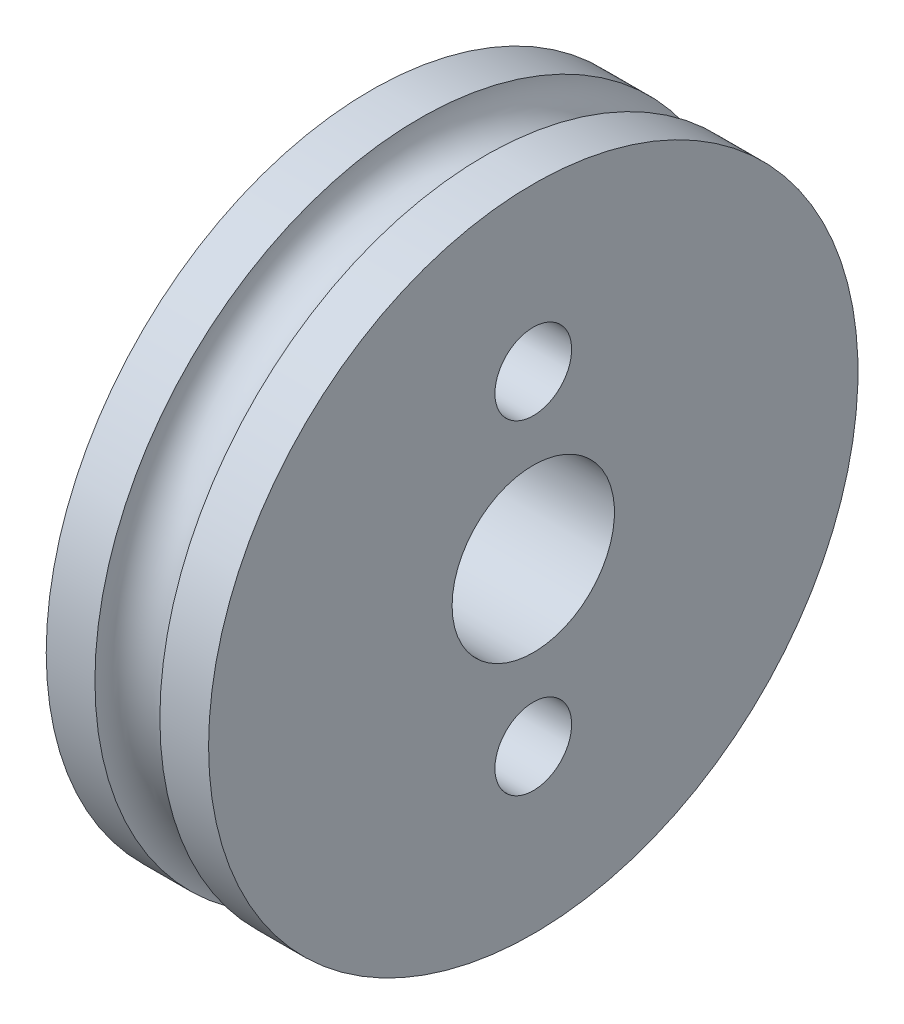
ISO-10303-21;
HEADER;
FILE_DESCRIPTION(('STEP AP214'),'2;1');
FILE_NAME('part.step','',(''),(''),'','','');
FILE_SCHEMA(('AUTOMOTIVE_DESIGN { 1 0 10303 214 1 1 1 1 }'));
ENDSEC;
DATA;
#1=APPLICATION_CONTEXT('core data for automotive mechanical design processes');
#2=APPLICATION_PROTOCOL_DEFINITION('international standard','automotive_design',2000,#1);
#3=PRODUCT_CONTEXT('',#1,'mechanical');
#4=PRODUCT('Part','Part','',(#3));
#5=PRODUCT_RELATED_PRODUCT_CATEGORY('part','',(#4));
#6=PRODUCT_DEFINITION_FORMATION('','',#4);
#7=PRODUCT_DEFINITION_CONTEXT('part definition',#1,'design');
#8=PRODUCT_DEFINITION('design','',#6,#7);
#9=PRODUCT_DEFINITION_SHAPE('','',#8);
#10=(LENGTH_UNIT() NAMED_UNIT(*) SI_UNIT(.MILLI.,.METRE.));
#11=(NAMED_UNIT(*) PLANE_ANGLE_UNIT() SI_UNIT($,.RADIAN.));
#12=(NAMED_UNIT(*) SI_UNIT($,.STERADIAN.) SOLID_ANGLE_UNIT());
#13=UNCERTAINTY_MEASURE_WITH_UNIT(LENGTH_MEASURE(1.E-05),#10,'distance_accuracy_value','');
#14=(GEOMETRIC_REPRESENTATION_CONTEXT(3) GLOBAL_UNCERTAINTY_ASSIGNED_CONTEXT((#13)) GLOBAL_UNIT_ASSIGNED_CONTEXT((#10,
#11,#12)) REPRESENTATION_CONTEXT('',''));
#15=CARTESIAN_POINT('',(0.,0.,0.));
#16=DIRECTION('',(0.,0.,1.));
#17=DIRECTION('',(1.,0.,0.));
#18=AXIS2_PLACEMENT_3D('',#15,#16,#17);
#19=CARTESIAN_POINT('',(0.,3.175,0.));
#20=DIRECTION('',(1.,0.,0.));
#21=DIRECTION('',(0.,0.,-1.));
#22=AXIS2_PLACEMENT_3D('',#19,#20,#21);
#23=PLANE('',#22);
#24=CARTESIAN_POINT('',(0.,6.35,0.));
#25=DIRECTION('',(-1.,0.,0.));
#26=DIRECTION('',(0.,0.,1.));
#27=AXIS2_PLACEMENT_3D('',#24,#25,#26);
#28=CIRCLE('',#27,1.525);
#29=CARTESIAN_POINT('',(0.,6.35,1.525));
#30=VERTEX_POINT('',#29);
#31=EDGE_CURVE('E76',#30,#30,#28,.T.);
#32=ORIENTED_EDGE('',*,*,#31,.F.);
#33=EDGE_LOOP('',(#32));
#34=FACE_BOUND('',#33,.T.);
#35=CARTESIAN_POINT('',(0.,-6.35,0.));
#36=DIRECTION('',(-1.,0.,0.));
#37=DIRECTION('',(0.,0.,1.));
#38=AXIS2_PLACEMENT_3D('',#35,#36,#37);
#39=CIRCLE('',#38,1.525);
#40=CARTESIAN_POINT('',(0.,-6.35,1.525));
#41=VERTEX_POINT('',#40);
#42=EDGE_CURVE('E67',#41,#41,#39,.T.);
#43=ORIENTED_EDGE('',*,*,#42,.F.);
#44=EDGE_LOOP('',(#43));
#45=FACE_BOUND('',#44,.T.);
#46=CARTESIAN_POINT('',(0.,0.,0.));
#47=DIRECTION('',(-1.,0.,0.));
#48=DIRECTION('',(0.,0.,1.));
#49=AXIS2_PLACEMENT_3D('',#46,#47,#48);
#50=CIRCLE('',#49,3.175);
#51=CARTESIAN_POINT('',(0.,0.,3.175));
#52=VERTEX_POINT('',#51);
#53=EDGE_CURVE('E10',#52,#52,#50,.T.);
#54=ORIENTED_EDGE('',*,*,#53,.F.);
#55=EDGE_LOOP('',(#54));
#56=FACE_BOUND('',#55,.T.);
#57=CARTESIAN_POINT('',(0.,0.,0.));
#58=DIRECTION('',(-1.,0.,0.));
#59=DIRECTION('',(0.,0.,1.));
#60=AXIS2_PLACEMENT_3D('',#57,#58,#59);
#61=CIRCLE('',#60,12.7);
#62=CARTESIAN_POINT('',(0.,0.,12.7));
#63=VERTEX_POINT('',#62);
#64=EDGE_CURVE('E58',#63,#63,#61,.T.);
#65=ORIENTED_EDGE('',*,*,#64,.T.);
#66=EDGE_LOOP('',(#65));
#67=FACE_BOUND('',#66,.T.);
#68=ADVANCED_FACE('F36',(#34,#45,#56,#67),#23,.F.);
#69=CARTESIAN_POINT('',(0.,0.,0.));
#70=DIRECTION('',(-1.,0.,0.));
#71=DIRECTION('',(0.,0.,1.));
#72=AXIS2_PLACEMENT_3D('',#69,#70,#71);
#73=CYLINDRICAL_SURFACE('',#72,3.175);
#74=CARTESIAN_POINT('',(6.35,0.,0.));
#75=DIRECTION('',(-1.,0.,0.));
#76=DIRECTION('',(0.,0.,1.));
#77=AXIS2_PLACEMENT_3D('',#74,#75,#76);
#78=CIRCLE('',#77,3.175);
#79=CARTESIAN_POINT('',(6.35,0.,3.175));
#80=VERTEX_POINT('',#79);
#81=EDGE_CURVE('E42',#80,#80,#78,.T.);
#82=ORIENTED_EDGE('',*,*,#81,.F.);
#83=EDGE_LOOP('',(#82));
#84=FACE_BOUND('',#83,.T.);
#85=ORIENTED_EDGE('',*,*,#53,.T.);
#86=EDGE_LOOP('',(#85));
#87=FACE_BOUND('',#86,.T.);
#88=ADVANCED_FACE('F84',(#84,#87),#73,.F.);
#89=CARTESIAN_POINT('',(6.35,3.175,0.));
#90=DIRECTION('',(-1.,0.,0.));
#91=DIRECTION('',(0.,0.,1.));
#92=AXIS2_PLACEMENT_3D('',#89,#90,#91);
#93=PLANE('',#92);
#94=CARTESIAN_POINT('',(6.34999999999999,6.35,0.));
#95=DIRECTION('',(-1.,0.,0.));
#96=DIRECTION('',(0.,0.,1.));
#97=AXIS2_PLACEMENT_3D('',#94,#95,#96);
#98=CIRCLE('',#97,1.49999999999999);
#99=CARTESIAN_POINT('',(6.34999999999999,6.35,1.49999999999999));
#100=VERTEX_POINT('',#99);
#101=EDGE_CURVE('E70',#100,#100,#98,.T.);
#102=ORIENTED_EDGE('',*,*,#101,.T.);
#103=EDGE_LOOP('',(#102));
#104=FACE_BOUND('',#103,.T.);
#105=CARTESIAN_POINT('',(6.34999999999999,-6.35,0.));
#106=DIRECTION('',(-1.,0.,0.));
#107=DIRECTION('',(0.,0.,1.));
#108=AXIS2_PLACEMENT_3D('',#105,#106,#107);
#109=CIRCLE('',#108,1.49999999999999);
#110=CARTESIAN_POINT('',(6.34999999999999,-6.35,1.49999999999999));
#111=VERTEX_POINT('',#110);
#112=EDGE_CURVE('E61',#111,#111,#109,.T.);
#113=ORIENTED_EDGE('',*,*,#112,.T.);
#114=EDGE_LOOP('',(#113));
#115=FACE_BOUND('',#114,.T.);
#116=CARTESIAN_POINT('',(6.35,0.,0.));
#117=DIRECTION('',(-1.,0.,0.));
#118=DIRECTION('',(0.,0.,1.));
#119=AXIS2_PLACEMENT_3D('',#116,#117,#118);
#120=CIRCLE('',#119,12.7);
#121=CARTESIAN_POINT('',(6.35,0.,12.7));
#122=VERTEX_POINT('',#121);
#123=EDGE_CURVE('E46',#122,#122,#120,.T.);
#124=ORIENTED_EDGE('',*,*,#123,.F.);
#125=EDGE_LOOP('',(#124));
#126=FACE_BOUND('',#125,.T.);
#127=ORIENTED_EDGE('',*,*,#81,.T.);
#128=EDGE_LOOP('',(#127));
#129=FACE_BOUND('',#128,.T.);
#130=ADVANCED_FACE('F106',(#104,#115,#126,#129),#93,.F.);
#131=CARTESIAN_POINT('',(0.,0.,0.));
#132=DIRECTION('',(-1.,0.,0.));
#133=DIRECTION('',(0.,0.,1.));
#134=AXIS2_PLACEMENT_3D('',#131,#132,#133);
#135=CYLINDRICAL_SURFACE('',#134,12.7);
#136=CARTESIAN_POINT('',(4.445,0.,0.));
#137=DIRECTION('',(-1.,0.,0.));
#138=DIRECTION('',(0.,0.,1.));
#139=AXIS2_PLACEMENT_3D('',#136,#137,#138);
#140=CIRCLE('',#139,12.7);
#141=CARTESIAN_POINT('',(4.445,0.,12.7));
#142=VERTEX_POINT('',#141);
#143=EDGE_CURVE('E50',#142,#142,#140,.T.);
#144=ORIENTED_EDGE('',*,*,#143,.F.);
#145=EDGE_LOOP('',(#144));
#146=FACE_BOUND('',#145,.T.);
#147=ORIENTED_EDGE('',*,*,#123,.T.);
#148=EDGE_LOOP('',(#147));
#149=FACE_BOUND('',#148,.T.);
#150=ADVANCED_FACE('F100',(#146,#149),#135,.T.);
#151=CARTESIAN_POINT('',(3.175,0.,0.));
#152=DIRECTION('',(-1.,0.,0.));
#153=DIRECTION('',(0.,0.,1.));
#154=AXIS2_PLACEMENT_3D('',#151,#152,#153);
#155=TOROIDAL_SURFACE('',#154,12.7,1.27);
#156=CARTESIAN_POINT('',(1.905,0.,0.));
#157=DIRECTION('',(-1.,0.,0.));
#158=DIRECTION('',(0.,0.,1.));
#159=AXIS2_PLACEMENT_3D('',#156,#157,#158);
#160=CIRCLE('',#159,12.7);
#161=CARTESIAN_POINT('',(1.905,0.,12.7));
#162=VERTEX_POINT('',#161);
#163=EDGE_CURVE('E55',#162,#162,#160,.T.);
#164=ORIENTED_EDGE('',*,*,#163,.F.);
#165=EDGE_LOOP('',(#164));
#166=FACE_BOUND('',#165,.T.);
#167=ORIENTED_EDGE('',*,*,#143,.T.);
#168=EDGE_LOOP('',(#167));
#169=FACE_BOUND('',#168,.T.);
#170=ADVANCED_FACE('F94',(#166,#169),#155,.F.);
#171=CARTESIAN_POINT('',(0.,0.,0.));
#172=DIRECTION('',(-1.,0.,0.));
#173=DIRECTION('',(0.,0.,1.));
#174=AXIS2_PLACEMENT_3D('',#171,#172,#173);
#175=CYLINDRICAL_SURFACE('',#174,12.7);
#176=ORIENTED_EDGE('',*,*,#64,.F.);
#177=EDGE_LOOP('',(#176));
#178=FACE_BOUND('',#177,.T.);
#179=ORIENTED_EDGE('',*,*,#163,.T.);
#180=EDGE_LOOP('',(#179));
#181=FACE_BOUND('',#180,.T.);
#182=ADVANCED_FACE('F90',(#178,#181),#175,.T.);
#183=CARTESIAN_POINT('',(0.,-6.35,0.));
#184=DIRECTION('',(-1.,0.,0.));
#185=DIRECTION('',(0.,0.,1.));
#186=AXIS2_PLACEMENT_3D('',#183,#184,#185);
#187=CYLINDRICAL_SURFACE('',#186,1.49999999999999);
#188=ORIENTED_EDGE('',*,*,#112,.F.);
#189=EDGE_LOOP('',(#188));
#190=FACE_BOUND('',#189,.T.);
#191=CARTESIAN_POINT('',(0.0250000000000016,-6.35,0.));
#192=DIRECTION('',(-1.,0.,0.));
#193=DIRECTION('',(0.,0.,1.));
#194=AXIS2_PLACEMENT_3D('',#191,#192,#193);
#195=CIRCLE('',#194,1.5);
#196=CARTESIAN_POINT('',(0.0250000000000016,-6.35,1.5));
#197=VERTEX_POINT('',#196);
#198=EDGE_CURVE('E64',#197,#197,#195,.T.);
#199=ORIENTED_EDGE('',*,*,#198,.T.);
#200=EDGE_LOOP('',(#199));
#201=FACE_BOUND('',#200,.T.);
#202=ADVANCED_FACE('F93',(#190,#201),#187,.F.);
#203=CARTESIAN_POINT('',(0.,-6.35,0.));
#204=DIRECTION('',(-1.,0.,0.));
#205=DIRECTION('',(0.,0.,1.));
#206=AXIS2_PLACEMENT_3D('',#203,#204,#205);
#207=CONICAL_SURFACE('',#206,1.525,0.785398163397396);
#208=ORIENTED_EDGE('',*,*,#198,.F.);
#209=EDGE_LOOP('',(#208));
#210=FACE_BOUND('',#209,.T.);
#211=ORIENTED_EDGE('',*,*,#42,.T.);
#212=EDGE_LOOP('',(#211));
#213=FACE_BOUND('',#212,.T.);
#214=ADVANCED_FACE('F121',(#210,#213),#207,.F.);
#215=CARTESIAN_POINT('',(0.,6.35,0.));
#216=DIRECTION('',(-1.,0.,0.));
#217=DIRECTION('',(0.,0.,1.));
#218=AXIS2_PLACEMENT_3D('',#215,#216,#217);
#219=CYLINDRICAL_SURFACE('',#218,1.49999999999999);
#220=ORIENTED_EDGE('',*,*,#101,.F.);
#221=EDGE_LOOP('',(#220));
#222=FACE_BOUND('',#221,.T.);
#223=CARTESIAN_POINT('',(0.0250000000000016,6.35,0.));
#224=DIRECTION('',(-1.,0.,0.));
#225=DIRECTION('',(0.,0.,1.));
#226=AXIS2_PLACEMENT_3D('',#223,#224,#225);
#227=CIRCLE('',#226,1.5);
#228=CARTESIAN_POINT('',(0.0250000000000016,6.35,1.5));
#229=VERTEX_POINT('',#228);
#230=EDGE_CURVE('E73',#229,#229,#227,.T.);
#231=ORIENTED_EDGE('',*,*,#230,.T.);
#232=EDGE_LOOP('',(#231));
#233=FACE_BOUND('',#232,.T.);
#234=ADVANCED_FACE('F125',(#222,#233),#219,.F.);
#235=CARTESIAN_POINT('',(0.,6.35,0.));
#236=DIRECTION('',(-1.,0.,0.));
#237=DIRECTION('',(0.,0.,1.));
#238=AXIS2_PLACEMENT_3D('',#235,#236,#237);
#239=CONICAL_SURFACE('',#238,1.525,0.785398163397396);
#240=ORIENTED_EDGE('',*,*,#230,.F.);
#241=EDGE_LOOP('',(#240));
#242=FACE_BOUND('',#241,.T.);
#243=ORIENTED_EDGE('',*,*,#31,.T.);
#244=EDGE_LOOP('',(#243));
#245=FACE_BOUND('',#244,.T.);
#246=ADVANCED_FACE('F80',(#242,#245),#239,.F.);
#247=CLOSED_SHELL('',(#68,#88,#130,#150,#170,#182,#202,#214,#234,#246));
#248=MANIFOLD_SOLID_BREP('B2',#247);
#249=ADVANCED_BREP_SHAPE_REPRESENTATION('',(#18,#248),#14);
#250=SHAPE_DEFINITION_REPRESENTATION(#9,#249);
ENDSEC;
END-ISO-10303-21;
